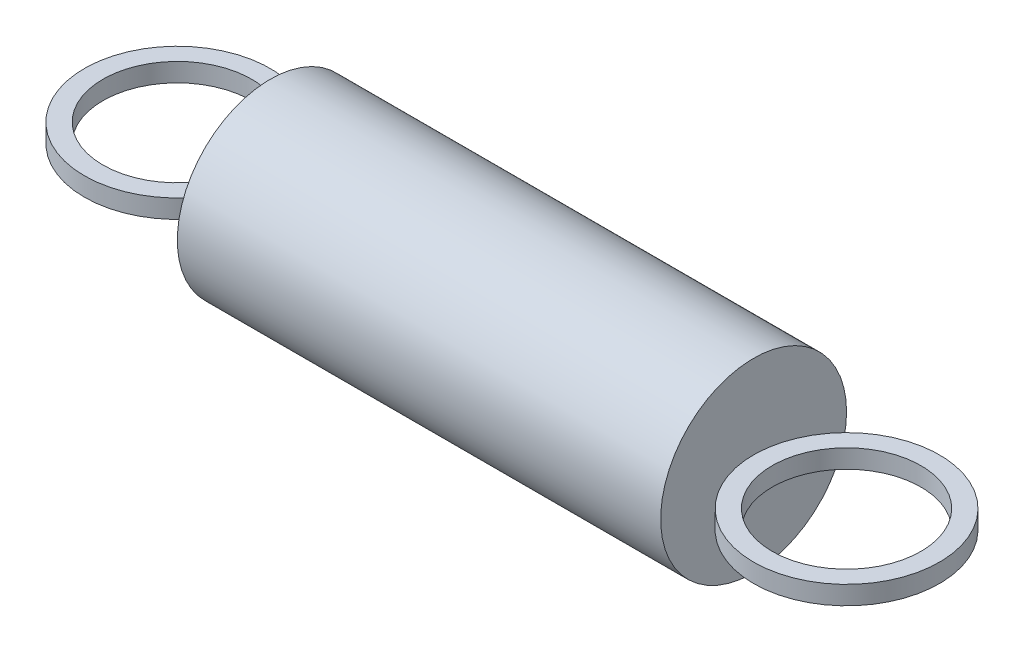
ISO-10303-21;
HEADER;
FILE_DESCRIPTION(('STEP AP214'),'2;1');
FILE_NAME('part.step','',(''),(''),'','','');
FILE_SCHEMA(('AUTOMOTIVE_DESIGN { 1 0 10303 214 1 1 1 1 }'));
ENDSEC;
DATA;
#1=APPLICATION_CONTEXT('core data for automotive mechanical design processes');
#2=APPLICATION_PROTOCOL_DEFINITION('international standard','automotive_design',2000,#1);
#3=PRODUCT_CONTEXT('',#1,'mechanical');
#4=PRODUCT('Part','Part','',(#3));
#5=PRODUCT_RELATED_PRODUCT_CATEGORY('part','',(#4));
#6=PRODUCT_DEFINITION_FORMATION('','',#4);
#7=PRODUCT_DEFINITION_CONTEXT('part definition',#1,'design');
#8=PRODUCT_DEFINITION('design','',#6,#7);
#9=PRODUCT_DEFINITION_SHAPE('','',#8);
#10=(LENGTH_UNIT() NAMED_UNIT(*) SI_UNIT(.MILLI.,.METRE.));
#11=(NAMED_UNIT(*) PLANE_ANGLE_UNIT() SI_UNIT($,.RADIAN.));
#12=(NAMED_UNIT(*) SI_UNIT($,.STERADIAN.) SOLID_ANGLE_UNIT());
#13=UNCERTAINTY_MEASURE_WITH_UNIT(LENGTH_MEASURE(1.E-05),#10,'distance_accuracy_value','');
#14=(GEOMETRIC_REPRESENTATION_CONTEXT(3) GLOBAL_UNCERTAINTY_ASSIGNED_CONTEXT((#13)) GLOBAL_UNIT_ASSIGNED_CONTEXT((#10,
#11,#12)) REPRESENTATION_CONTEXT('',''));
#15=CARTESIAN_POINT('',(0.,0.,0.));
#16=DIRECTION('',(0.,0.,1.));
#17=DIRECTION('',(1.,0.,0.));
#18=AXIS2_PLACEMENT_3D('',#15,#16,#17);
#19=CARTESIAN_POINT('',(24.60625,0.396875,0.));
#20=DIRECTION('',(0.,1.,0.));
#21=DIRECTION('',(0.,0.,1.));
#22=AXIS2_PLACEMENT_3D('',#19,#20,#21);
#23=PLANE('',#22);
#24=CARTESIAN_POINT('',(24.60625,0.396875,0.));
#25=DIRECTION('',(0.,1.,0.));
#26=DIRECTION('',(0.,0.,1.));
#27=AXIS2_PLACEMENT_3D('',#24,#25,#26);
#28=CIRCLE('',#27,3.96875);
#29=CARTESIAN_POINT('',(24.60625,0.396875,3.96875));
#30=VERTEX_POINT('',#29);
#31=EDGE_CURVE('E11',#30,#30,#28,.T.);
#32=ORIENTED_EDGE('',*,*,#31,.T.);
#33=EDGE_LOOP('',(#32));
#34=FACE_BOUND('',#33,.T.);
#35=CARTESIAN_POINT('',(24.60625,0.396875,0.));
#36=DIRECTION('',(0.,1.,0.));
#37=DIRECTION('',(0.,0.,1.));
#38=AXIS2_PLACEMENT_3D('',#35,#36,#37);
#39=CIRCLE('',#38,3.17500000000001);
#40=CARTESIAN_POINT('',(24.60625,0.396875,3.17500000000001));
#41=VERTEX_POINT('',#40);
#42=EDGE_CURVE('E54',#41,#41,#39,.T.);
#43=ORIENTED_EDGE('',*,*,#42,.F.);
#44=EDGE_LOOP('',(#43));
#45=FACE_BOUND('',#44,.T.);
#46=ADVANCED_FACE('F43',(#34,#45),#23,.T.);
#47=CARTESIAN_POINT('',(24.60625,-0.396875,0.));
#48=DIRECTION('',(0.,1.,0.));
#49=DIRECTION('',(0.,0.,1.));
#50=AXIS2_PLACEMENT_3D('',#47,#48,#49);
#51=PLANE('',#50);
#52=CARTESIAN_POINT('',(24.60625,-0.396875,0.));
#53=DIRECTION('',(0.,1.,0.));
#54=DIRECTION('',(0.,0.,1.));
#55=AXIS2_PLACEMENT_3D('',#52,#53,#54);
#56=CIRCLE('',#55,3.96875);
#57=CARTESIAN_POINT('',(24.60625,-0.396875,3.96875));
#58=VERTEX_POINT('',#57);
#59=EDGE_CURVE('E47',#58,#58,#56,.T.);
#60=ORIENTED_EDGE('',*,*,#59,.F.);
#61=EDGE_LOOP('',(#60));
#62=FACE_BOUND('',#61,.T.);
#63=CARTESIAN_POINT('',(24.60625,-0.396875,0.));
#64=DIRECTION('',(0.,1.,0.));
#65=DIRECTION('',(0.,0.,1.));
#66=AXIS2_PLACEMENT_3D('',#63,#64,#65);
#67=CIRCLE('',#66,3.17500000000001);
#68=CARTESIAN_POINT('',(24.60625,-0.396875,3.17500000000001));
#69=VERTEX_POINT('',#68);
#70=EDGE_CURVE('E56',#69,#69,#67,.T.);
#71=ORIENTED_EDGE('',*,*,#70,.T.);
#72=EDGE_LOOP('',(#71));
#73=FACE_BOUND('',#72,.T.);
#74=ADVANCED_FACE('F66',(#62,#73),#51,.F.);
#75=CARTESIAN_POINT('',(24.60625,0.396875,0.));
#76=DIRECTION('',(0.,-1.,0.));
#77=DIRECTION('',(0.,0.,-1.));
#78=AXIS2_PLACEMENT_3D('',#75,#76,#77);
#79=CYLINDRICAL_SURFACE('',#78,3.96875);
#80=ORIENTED_EDGE('',*,*,#31,.F.);
#81=EDGE_LOOP('',(#80));
#82=FACE_BOUND('',#81,.T.);
#83=ORIENTED_EDGE('',*,*,#59,.T.);
#84=EDGE_LOOP('',(#83));
#85=FACE_BOUND('',#84,.T.);
#86=ADVANCED_FACE('F45',(#82,#85),#79,.T.);
#87=CARTESIAN_POINT('',(24.60625,0.396875,0.));
#88=DIRECTION('',(0.,-1.,0.));
#89=DIRECTION('',(0.,0.,-1.));
#90=AXIS2_PLACEMENT_3D('',#87,#88,#89);
#91=CYLINDRICAL_SURFACE('',#90,3.17500000000001);
#92=ORIENTED_EDGE('',*,*,#42,.T.);
#93=EDGE_LOOP('',(#92));
#94=FACE_BOUND('',#93,.T.);
#95=ORIENTED_EDGE('',*,*,#70,.F.);
#96=EDGE_LOOP('',(#95));
#97=FACE_BOUND('',#96,.T.);
#98=ADVANCED_FACE('F62',(#94,#97),#91,.F.);
#99=CLOSED_SHELL('',(#46,#74,#86,#98));
#100=MANIFOLD_SOLID_BREP('B2',#99);
#101=CARTESIAN_POINT('',(-3.96875,0.396875,0.));
#102=DIRECTION('',(0.,1.,0.));
#103=DIRECTION('',(0.,0.,1.));
#104=AXIS2_PLACEMENT_3D('',#101,#102,#103);
#105=PLANE('',#104);
#106=CARTESIAN_POINT('',(-3.96875,0.396875,0.));
#107=DIRECTION('',(0.,1.,0.));
#108=DIRECTION('',(0.,0.,1.));
#109=AXIS2_PLACEMENT_3D('',#106,#107,#108);
#110=CIRCLE('',#109,3.96875);
#111=CARTESIAN_POINT('',(-3.96875,0.396875,3.96875));
#112=VERTEX_POINT('',#111);
#113=EDGE_CURVE('E42',#112,#112,#110,.T.);
#114=ORIENTED_EDGE('',*,*,#113,.T.);
#115=EDGE_LOOP('',(#114));
#116=FACE_BOUND('',#115,.T.);
#117=CARTESIAN_POINT('',(-3.96875,0.396875,0.));
#118=DIRECTION('',(0.,1.,0.));
#119=DIRECTION('',(0.,0.,1.));
#120=AXIS2_PLACEMENT_3D('',#117,#118,#119);
#121=CIRCLE('',#120,3.175);
#122=CARTESIAN_POINT('',(-3.96875,0.396875,3.175));
#123=VERTEX_POINT('',#122);
#124=EDGE_CURVE('E122',#123,#123,#121,.T.);
#125=ORIENTED_EDGE('',*,*,#124,.F.);
#126=EDGE_LOOP('',(#125));
#127=FACE_BOUND('',#126,.T.);
#128=ADVANCED_FACE('F111',(#116,#127),#105,.T.);
#129=CARTESIAN_POINT('',(-3.96875,-0.396875,0.));
#130=DIRECTION('',(0.,1.,0.));
#131=DIRECTION('',(0.,0.,1.));
#132=AXIS2_PLACEMENT_3D('',#129,#130,#131);
#133=PLANE('',#132);
#134=CARTESIAN_POINT('',(-3.96875,-0.396875,0.));
#135=DIRECTION('',(0.,1.,0.));
#136=DIRECTION('',(0.,0.,1.));
#137=AXIS2_PLACEMENT_3D('',#134,#135,#136);
#138=CIRCLE('',#137,3.96875);
#139=CARTESIAN_POINT('',(-3.96875,-0.396875,3.96875));
#140=VERTEX_POINT('',#139);
#141=EDGE_CURVE('E115',#140,#140,#138,.T.);
#142=ORIENTED_EDGE('',*,*,#141,.F.);
#143=EDGE_LOOP('',(#142));
#144=FACE_BOUND('',#143,.T.);
#145=CARTESIAN_POINT('',(-3.96875,-0.396875,0.));
#146=DIRECTION('',(0.,1.,0.));
#147=DIRECTION('',(0.,0.,1.));
#148=AXIS2_PLACEMENT_3D('',#145,#146,#147);
#149=CIRCLE('',#148,3.175);
#150=CARTESIAN_POINT('',(-3.96875,-0.396875,3.175));
#151=VERTEX_POINT('',#150);
#152=EDGE_CURVE('E124',#151,#151,#149,.T.);
#153=ORIENTED_EDGE('',*,*,#152,.T.);
#154=EDGE_LOOP('',(#153));
#155=FACE_BOUND('',#154,.T.);
#156=ADVANCED_FACE('F134',(#144,#155),#133,.F.);
#157=CARTESIAN_POINT('',(-3.96875,0.396875,0.));
#158=DIRECTION('',(0.,-1.,0.));
#159=DIRECTION('',(0.,0.,-1.));
#160=AXIS2_PLACEMENT_3D('',#157,#158,#159);
#161=CYLINDRICAL_SURFACE('',#160,3.96875);
#162=ORIENTED_EDGE('',*,*,#113,.F.);
#163=EDGE_LOOP('',(#162));
#164=FACE_BOUND('',#163,.T.);
#165=ORIENTED_EDGE('',*,*,#141,.T.);
#166=EDGE_LOOP('',(#165));
#167=FACE_BOUND('',#166,.T.);
#168=ADVANCED_FACE('F113',(#164,#167),#161,.T.);
#169=CARTESIAN_POINT('',(-3.96875,0.396875,0.));
#170=DIRECTION('',(0.,-1.,0.));
#171=DIRECTION('',(0.,0.,-1.));
#172=AXIS2_PLACEMENT_3D('',#169,#170,#171);
#173=CYLINDRICAL_SURFACE('',#172,3.175);
#174=ORIENTED_EDGE('',*,*,#124,.T.);
#175=EDGE_LOOP('',(#174));
#176=FACE_BOUND('',#175,.T.);
#177=ORIENTED_EDGE('',*,*,#152,.F.);
#178=EDGE_LOOP('',(#177));
#179=FACE_BOUND('',#178,.T.);
#180=ADVANCED_FACE('F130',(#176,#179),#173,.F.);
#181=CLOSED_SHELL('',(#128,#156,#168,#180));
#182=MANIFOLD_SOLID_BREP('B6',#181);
#183=CARTESIAN_POINT('',(20.6375,0.,0.));
#184=DIRECTION('',(-1.,0.,0.));
#185=DIRECTION('',(0.,0.,1.));
#186=AXIS2_PLACEMENT_3D('',#183,#184,#185);
#187=CYLINDRICAL_SURFACE('',#186,3.96875);
#188=CARTESIAN_POINT('',(20.6375,0.,0.));
#189=DIRECTION('',(1.,0.,0.));
#190=DIRECTION('',(0.,0.,-1.));
#191=AXIS2_PLACEMENT_3D('',#188,#189,#190);
#192=CIRCLE('',#191,3.96875);
#193=CARTESIAN_POINT('',(20.6375,0.,-3.96875));
#194=VERTEX_POINT('',#193);
#195=EDGE_CURVE('E110',#194,#194,#192,.T.);
#196=ORIENTED_EDGE('',*,*,#195,.F.);
#197=EDGE_LOOP('',(#196));
#198=FACE_BOUND('',#197,.T.);
#199=CARTESIAN_POINT('',(0.,0.,0.));
#200=DIRECTION('',(1.,0.,0.));
#201=DIRECTION('',(0.,0.,-1.));
#202=AXIS2_PLACEMENT_3D('',#199,#200,#201);
#203=CIRCLE('',#202,3.96875);
#204=CARTESIAN_POINT('',(0.,0.,-3.96875));
#205=VERTEX_POINT('',#204);
#206=EDGE_CURVE('E175',#205,#205,#203,.T.);
#207=ORIENTED_EDGE('',*,*,#206,.T.);
#208=EDGE_LOOP('',(#207));
#209=FACE_BOUND('',#208,.T.);
#210=ADVANCED_FACE('F172',(#198,#209),#187,.T.);
#211=CARTESIAN_POINT('',(20.6375,0.,0.));
#212=DIRECTION('',(1.,0.,0.));
#213=DIRECTION('',(0.,0.,-1.));
#214=AXIS2_PLACEMENT_3D('',#211,#212,#213);
#215=PLANE('',#214);
#216=ORIENTED_EDGE('',*,*,#195,.T.);
#217=EDGE_LOOP('',(#216));
#218=FACE_BOUND('',#217,.T.);
#219=ADVANCED_FACE('F187',(#218),#215,.T.);
#220=CARTESIAN_POINT('',(0.,0.,0.));
#221=DIRECTION('',(1.,0.,0.));
#222=DIRECTION('',(0.,0.,-1.));
#223=AXIS2_PLACEMENT_3D('',#220,#221,#222);
#224=PLANE('',#223);
#225=ORIENTED_EDGE('',*,*,#206,.F.);
#226=EDGE_LOOP('',(#225));
#227=FACE_BOUND('',#226,.T.);
#228=ADVANCED_FACE('F185',(#227),#224,.F.);
#229=CLOSED_SHELL('',(#210,#219,#228));
#230=MANIFOLD_SOLID_BREP('B37',#229);
#231=ADVANCED_BREP_SHAPE_REPRESENTATION('',(#18,#100,#182,#230),#14);
#232=SHAPE_DEFINITION_REPRESENTATION(#9,#231);
ENDSEC;
END-ISO-10303-21;
